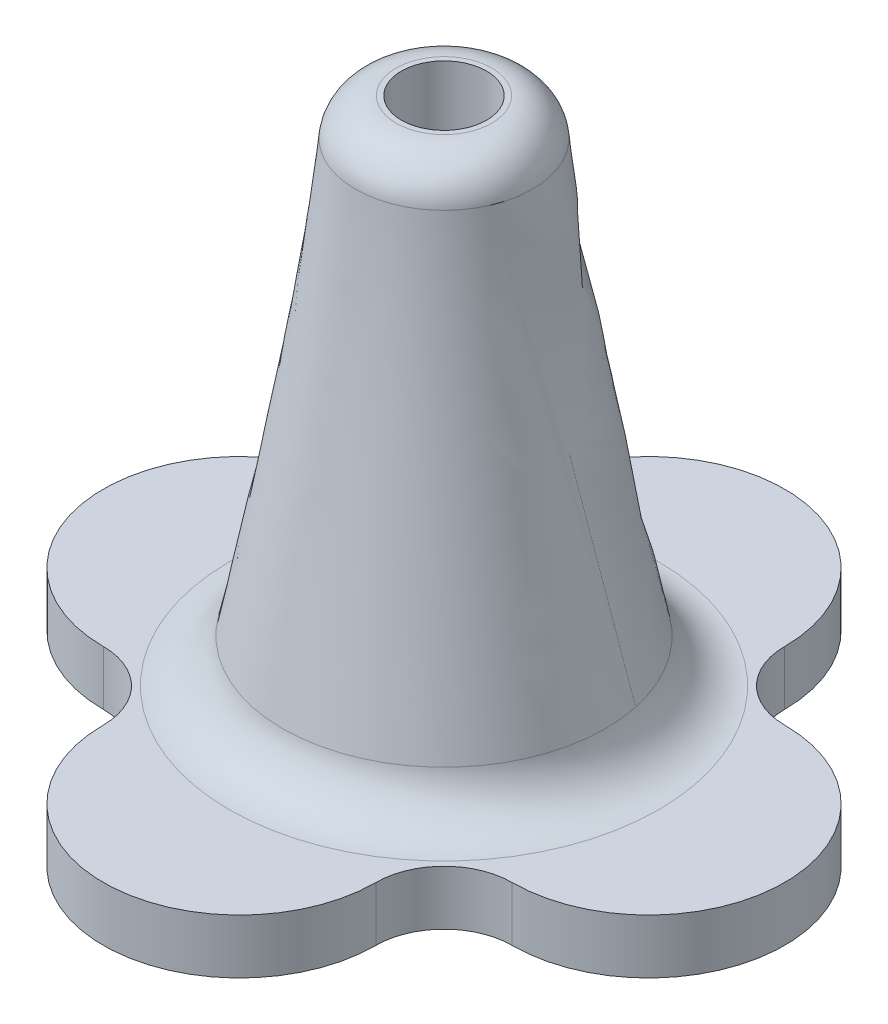
ISO-10303-21;
HEADER;
FILE_DESCRIPTION(('STEP AP214'),'2;1');
FILE_NAME('part.step','',(''),(''),'','','');
FILE_SCHEMA(('AUTOMOTIVE_DESIGN { 1 0 10303 214 1 1 1 1 }'));
ENDSEC;
DATA;
#1=APPLICATION_CONTEXT('core data for automotive mechanical design processes');
#2=APPLICATION_PROTOCOL_DEFINITION('international standard','automotive_design',2000,#1);
#3=PRODUCT_CONTEXT('',#1,'mechanical');
#4=PRODUCT('Part','Part','',(#3));
#5=PRODUCT_RELATED_PRODUCT_CATEGORY('part','',(#4));
#6=PRODUCT_DEFINITION_FORMATION('','',#4);
#7=PRODUCT_DEFINITION_CONTEXT('part definition',#1,'design');
#8=PRODUCT_DEFINITION('design','',#6,#7);
#9=PRODUCT_DEFINITION_SHAPE('','',#8);
#10=(LENGTH_UNIT() NAMED_UNIT(*) SI_UNIT(.MILLI.,.METRE.));
#11=(NAMED_UNIT(*) PLANE_ANGLE_UNIT() SI_UNIT($,.RADIAN.));
#12=(NAMED_UNIT(*) SI_UNIT($,.STERADIAN.) SOLID_ANGLE_UNIT());
#13=UNCERTAINTY_MEASURE_WITH_UNIT(LENGTH_MEASURE(1.E-05),#10,'distance_accuracy_value','');
#14=(GEOMETRIC_REPRESENTATION_CONTEXT(3) GLOBAL_UNCERTAINTY_ASSIGNED_CONTEXT((#13)) GLOBAL_UNIT_ASSIGNED_CONTEXT((#10,
#11,#12)) REPRESENTATION_CONTEXT('',''));
#15=CARTESIAN_POINT('',(0.,0.,0.));
#16=DIRECTION('',(0.,0.,1.));
#17=DIRECTION('',(1.,0.,0.));
#18=AXIS2_PLACEMENT_3D('',#15,#16,#17);
#19=CARTESIAN_POINT('',(0.,2.032,7.61999999999999));
#20=DIRECTION('',(0.,1.,0.));
#21=DIRECTION('',(0.,0.,1.));
#22=AXIS2_PLACEMENT_3D('',#19,#20,#21);
#23=PLANE('',#22);
#24=CARTESIAN_POINT('',(0.,2.032,0.));
#25=DIRECTION('',(0.,1.,0.));
#26=DIRECTION('',(0.,0.,1.));
#27=AXIS2_PLACEMENT_3D('',#24,#25,#26);
#28=CIRCLE('',#27,8.00168832977599);
#29=CARTESIAN_POINT('',(0.,2.032,8.00168832977599));
#30=VERTEX_POINT('',#29);
#31=EDGE_CURVE('E158',#30,#30,#28,.F.);
#32=ORIENTED_EDGE('',*,*,#31,.T.);
#33=EDGE_LOOP('',(#32));
#34=FACE_BOUND('',#33,.T.);
#35=CARTESIAN_POINT('',(0.,2.032,7.61999999999999));
#36=DIRECTION('',(0.,1.,0.));
#37=DIRECTION('',(0.,0.,1.));
#38=AXIS2_PLACEMENT_3D('',#35,#36,#37);
#39=CIRCLE('',#38,5.08);
#40=CARTESIAN_POINT('',(-5.08,2.032,7.61999999999999));
#41=VERTEX_POINT('',#40);
#42=CARTESIAN_POINT('',(5.08,2.032,7.61999999999999));
#43=VERTEX_POINT('',#42);
#44=EDGE_CURVE('E92',#41,#43,#39,.T.);
#45=ORIENTED_EDGE('',*,*,#44,.T.);
#46=CARTESIAN_POINT('',(7.62,2.032,7.62));
#47=DIRECTION('',(0.,1.,0.));
#48=DIRECTION('',(0.,0.,1.));
#49=AXIS2_PLACEMENT_3D('',#46,#47,#48);
#50=CIRCLE('',#49,2.54);
#51=CARTESIAN_POINT('',(7.61999999999999,2.032,5.08));
#52=VERTEX_POINT('',#51);
#53=EDGE_CURVE('E149',#43,#52,#50,.F.);
#54=ORIENTED_EDGE('',*,*,#53,.T.);
#55=CARTESIAN_POINT('',(7.61999999999999,2.032,0.));
#56=DIRECTION('',(0.,1.,0.));
#57=DIRECTION('',(0.,0.,1.));
#58=AXIS2_PLACEMENT_3D('',#55,#56,#57);
#59=CIRCLE('',#58,5.08);
#60=CARTESIAN_POINT('',(7.61999999999999,2.032,-5.08));
#61=VERTEX_POINT('',#60);
#62=EDGE_CURVE('E220',#52,#61,#59,.T.);
#63=ORIENTED_EDGE('',*,*,#62,.T.);
#64=CARTESIAN_POINT('',(7.62,2.032,-7.62));
#65=DIRECTION('',(0.,1.,0.));
#66=DIRECTION('',(0.,0.,1.));
#67=AXIS2_PLACEMENT_3D('',#64,#65,#66);
#68=CIRCLE('',#67,2.54);
#69=CARTESIAN_POINT('',(5.08,2.032,-7.61999999999999));
#70=VERTEX_POINT('',#69);
#71=EDGE_CURVE('E153',#61,#70,#68,.F.);
#72=ORIENTED_EDGE('',*,*,#71,.T.);
#73=CARTESIAN_POINT('',(0.,2.032,-7.61999999999999));
#74=DIRECTION('',(0.,1.,0.));
#75=DIRECTION('',(0.,0.,1.));
#76=AXIS2_PLACEMENT_3D('',#73,#74,#75);
#77=CIRCLE('',#76,5.08);
#78=CARTESIAN_POINT('',(-5.08,2.032,-7.61999999999999));
#79=VERTEX_POINT('',#78);
#80=EDGE_CURVE('E111',#70,#79,#77,.T.);
#81=ORIENTED_EDGE('',*,*,#80,.T.);
#82=CARTESIAN_POINT('',(-7.62,2.032,-7.62));
#83=DIRECTION('',(0.,1.,0.));
#84=DIRECTION('',(0.,0.,1.));
#85=AXIS2_PLACEMENT_3D('',#82,#83,#84);
#86=CIRCLE('',#85,2.54);
#87=CARTESIAN_POINT('',(-7.61999999999999,2.032,-5.08));
#88=VERTEX_POINT('',#87);
#89=EDGE_CURVE('E106',#79,#88,#86,.F.);
#90=ORIENTED_EDGE('',*,*,#89,.T.);
#91=CARTESIAN_POINT('',(-7.61999999999999,2.032,0.));
#92=DIRECTION('',(0.,1.,0.));
#93=DIRECTION('',(0.,0.,1.));
#94=AXIS2_PLACEMENT_3D('',#91,#92,#93);
#95=CIRCLE('',#94,5.08);
#96=CARTESIAN_POINT('',(-7.61999999999999,2.032,5.08));
#97=VERTEX_POINT('',#96);
#98=EDGE_CURVE('E108',#88,#97,#95,.T.);
#99=ORIENTED_EDGE('',*,*,#98,.T.);
#100=CARTESIAN_POINT('',(-7.62,2.032,7.62));
#101=DIRECTION('',(0.,1.,0.));
#102=DIRECTION('',(0.,0.,1.));
#103=AXIS2_PLACEMENT_3D('',#100,#101,#102);
#104=CIRCLE('',#103,2.54);
#105=EDGE_CURVE('E53',#97,#41,#104,.F.);
#106=ORIENTED_EDGE('',*,*,#105,.T.);
#107=EDGE_LOOP('',(#45,#54,#63,#72,#81,#90,#99,#106));
#108=FACE_BOUND('',#107,.T.);
#109=ADVANCED_FACE('F36',(#34,#108),#23,.T.);
#110=CARTESIAN_POINT('',(0.,2.032,7.61999999999999));
#111=DIRECTION('',(0.,-1.,0.));
#112=DIRECTION('',(0.,0.,-1.));
#113=AXIS2_PLACEMENT_3D('',#110,#111,#112);
#114=CYLINDRICAL_SURFACE('',#113,5.08);
#115=CARTESIAN_POINT('',(0.,0.,7.61999999999999));
#116=DIRECTION('',(0.,1.,0.));
#117=DIRECTION('',(0.,0.,1.));
#118=AXIS2_PLACEMENT_3D('',#115,#116,#117);
#119=CIRCLE('',#118,5.08);
#120=CARTESIAN_POINT('',(-5.08,0.,7.61999999999999));
#121=VERTEX_POINT('',#120);
#122=CARTESIAN_POINT('',(5.08,0.,7.61999999999999));
#123=VERTEX_POINT('',#122);
#124=EDGE_CURVE('E227',#121,#123,#119,.T.);
#125=ORIENTED_EDGE('',*,*,#124,.T.);
#126=DIRECTION('',(0.,-1.,0.));
#127=VECTOR('',#126,1.);
#128=CARTESIAN_POINT('',(5.08,2.032,7.61999999999999));
#129=LINE('',#128,#127);
#130=EDGE_CURVE('E141',#43,#123,#129,.T.);
#131=ORIENTED_EDGE('',*,*,#130,.F.);
#132=ORIENTED_EDGE('',*,*,#44,.F.);
#133=DIRECTION('',(0.,-1.,0.));
#134=VECTOR('',#133,1.);
#135=CARTESIAN_POINT('',(-5.08,2.032,7.61999999999999));
#136=LINE('',#135,#134);
#137=EDGE_CURVE('E123',#41,#121,#136,.T.);
#138=ORIENTED_EDGE('',*,*,#137,.T.);
#139=EDGE_LOOP('',(#125,#131,#132,#138));
#140=FACE_BOUND('',#139,.T.);
#141=ADVANCED_FACE('F176',(#140),#114,.T.);
#142=CARTESIAN_POINT('',(7.61999999999999,2.032,0.));
#143=DIRECTION('',(0.,-1.,0.));
#144=DIRECTION('',(0.,0.,-1.));
#145=AXIS2_PLACEMENT_3D('',#142,#143,#144);
#146=CYLINDRICAL_SURFACE('',#145,5.08);
#147=CARTESIAN_POINT('',(7.61999999999999,0.,0.));
#148=DIRECTION('',(0.,1.,0.));
#149=DIRECTION('',(0.,0.,1.));
#150=AXIS2_PLACEMENT_3D('',#147,#148,#149);
#151=CIRCLE('',#150,5.08);
#152=CARTESIAN_POINT('',(7.61999999999999,0.,5.08));
#153=VERTEX_POINT('',#152);
#154=CARTESIAN_POINT('',(7.61999999999999,0.,-5.08));
#155=VERTEX_POINT('',#154);
#156=EDGE_CURVE('E230',#153,#155,#151,.T.);
#157=ORIENTED_EDGE('',*,*,#156,.T.);
#158=DIRECTION('',(0.,-1.,0.));
#159=VECTOR('',#158,1.);
#160=CARTESIAN_POINT('',(7.61999999999999,2.032,-5.08));
#161=LINE('',#160,#159);
#162=EDGE_CURVE('E135',#61,#155,#161,.T.);
#163=ORIENTED_EDGE('',*,*,#162,.F.);
#164=ORIENTED_EDGE('',*,*,#62,.F.);
#165=DIRECTION('',(0.,-1.,0.));
#166=VECTOR('',#165,1.);
#167=CARTESIAN_POINT('',(7.61999999999999,2.032,5.08));
#168=LINE('',#167,#166);
#169=EDGE_CURVE('E138',#52,#153,#168,.T.);
#170=ORIENTED_EDGE('',*,*,#169,.T.);
#171=EDGE_LOOP('',(#157,#163,#164,#170));
#172=FACE_BOUND('',#171,.T.);
#173=ADVANCED_FACE('F182',(#172),#146,.T.);
#174=CARTESIAN_POINT('',(0.,2.032,-7.61999999999999));
#175=DIRECTION('',(0.,-1.,0.));
#176=DIRECTION('',(0.,0.,-1.));
#177=AXIS2_PLACEMENT_3D('',#174,#175,#176);
#178=CYLINDRICAL_SURFACE('',#177,5.08);
#179=CARTESIAN_POINT('',(0.,0.,-7.61999999999999));
#180=DIRECTION('',(0.,1.,0.));
#181=DIRECTION('',(0.,0.,1.));
#182=AXIS2_PLACEMENT_3D('',#179,#180,#181);
#183=CIRCLE('',#182,5.08);
#184=CARTESIAN_POINT('',(5.08,0.,-7.61999999999999));
#185=VERTEX_POINT('',#184);
#186=CARTESIAN_POINT('',(-5.08,0.,-7.61999999999999));
#187=VERTEX_POINT('',#186);
#188=EDGE_CURVE('E234',#185,#187,#183,.T.);
#189=ORIENTED_EDGE('',*,*,#188,.T.);
#190=DIRECTION('',(0.,-1.,0.));
#191=VECTOR('',#190,1.);
#192=CARTESIAN_POINT('',(-5.08,2.032,-7.61999999999999));
#193=LINE('',#192,#191);
#194=EDGE_CURVE('E126',#79,#187,#193,.T.);
#195=ORIENTED_EDGE('',*,*,#194,.F.);
#196=ORIENTED_EDGE('',*,*,#80,.F.);
#197=DIRECTION('',(0.,-1.,0.));
#198=VECTOR('',#197,1.);
#199=CARTESIAN_POINT('',(5.08,2.032,-7.61999999999999));
#200=LINE('',#199,#198);
#201=EDGE_CURVE('E128',#70,#185,#200,.T.);
#202=ORIENTED_EDGE('',*,*,#201,.T.);
#203=EDGE_LOOP('',(#189,#195,#196,#202));
#204=FACE_BOUND('',#203,.T.);
#205=ADVANCED_FACE('F193',(#204),#178,.T.);
#206=CARTESIAN_POINT('',(-7.61999999999999,2.032,0.));
#207=DIRECTION('',(0.,-1.,0.));
#208=DIRECTION('',(0.,0.,-1.));
#209=AXIS2_PLACEMENT_3D('',#206,#207,#208);
#210=CYLINDRICAL_SURFACE('',#209,5.08);
#211=CARTESIAN_POINT('',(-7.61999999999999,0.,0.));
#212=DIRECTION('',(0.,1.,0.));
#213=DIRECTION('',(0.,0.,1.));
#214=AXIS2_PLACEMENT_3D('',#211,#212,#213);
#215=CIRCLE('',#214,5.08);
#216=CARTESIAN_POINT('',(-7.61999999999999,0.,-5.08));
#217=VERTEX_POINT('',#216);
#218=CARTESIAN_POINT('',(-7.61999999999999,0.,5.08));
#219=VERTEX_POINT('',#218);
#220=EDGE_CURVE('E236',#217,#219,#215,.T.);
#221=ORIENTED_EDGE('',*,*,#220,.T.);
#222=DIRECTION('',(0.,-1.,0.));
#223=VECTOR('',#222,1.);
#224=CARTESIAN_POINT('',(-7.61999999999999,2.032,5.08));
#225=LINE('',#224,#223);
#226=EDGE_CURVE('E122',#97,#219,#225,.T.);
#227=ORIENTED_EDGE('',*,*,#226,.F.);
#228=ORIENTED_EDGE('',*,*,#98,.F.);
#229=DIRECTION('',(0.,-1.,0.));
#230=VECTOR('',#229,1.);
#231=CARTESIAN_POINT('',(-7.61999999999999,2.032,-5.08));
#232=LINE('',#231,#230);
#233=EDGE_CURVE('E121',#88,#217,#232,.T.);
#234=ORIENTED_EDGE('',*,*,#233,.T.);
#235=EDGE_LOOP('',(#221,#227,#228,#234));
#236=FACE_BOUND('',#235,.T.);
#237=ADVANCED_FACE('F120',(#236),#210,.T.);
#238=CARTESIAN_POINT('',(0.,0.,7.61999999999999));
#239=DIRECTION('',(0.,1.,0.));
#240=DIRECTION('',(0.,0.,1.));
#241=AXIS2_PLACEMENT_3D('',#238,#239,#240);
#242=PLANE('',#241);
#243=ORIENTED_EDGE('',*,*,#124,.F.);
#244=CARTESIAN_POINT('',(-7.62,0.,7.62));
#245=DIRECTION('',(0.,1.,0.));
#246=DIRECTION('',(0.,0.,1.));
#247=AXIS2_PLACEMENT_3D('',#244,#245,#246);
#248=CIRCLE('',#247,2.54);
#249=EDGE_CURVE('E82',#121,#219,#248,.T.);
#250=ORIENTED_EDGE('',*,*,#249,.T.);
#251=ORIENTED_EDGE('',*,*,#220,.F.);
#252=CARTESIAN_POINT('',(-7.62,0.,-7.62));
#253=DIRECTION('',(0.,1.,0.));
#254=DIRECTION('',(0.,0.,1.));
#255=AXIS2_PLACEMENT_3D('',#252,#253,#254);
#256=CIRCLE('',#255,2.54);
#257=EDGE_CURVE('E116',#217,#187,#256,.T.);
#258=ORIENTED_EDGE('',*,*,#257,.T.);
#259=ORIENTED_EDGE('',*,*,#188,.F.);
#260=CARTESIAN_POINT('',(7.62,0.,-7.62));
#261=DIRECTION('',(0.,1.,0.));
#262=DIRECTION('',(0.,0.,1.));
#263=AXIS2_PLACEMENT_3D('',#260,#261,#262);
#264=CIRCLE('',#263,2.54);
#265=EDGE_CURVE('E151',#185,#155,#264,.T.);
#266=ORIENTED_EDGE('',*,*,#265,.T.);
#267=ORIENTED_EDGE('',*,*,#156,.F.);
#268=CARTESIAN_POINT('',(7.62,0.,7.62));
#269=DIRECTION('',(0.,1.,0.));
#270=DIRECTION('',(0.,0.,1.));
#271=AXIS2_PLACEMENT_3D('',#268,#269,#270);
#272=CIRCLE('',#271,2.54);
#273=EDGE_CURVE('E147',#153,#123,#272,.T.);
#274=ORIENTED_EDGE('',*,*,#273,.T.);
#275=EDGE_LOOP('',(#243,#250,#251,#258,#259,#266,#267,#274));
#276=FACE_BOUND('',#275,.T.);
#277=ADVANCED_FACE('F188',(#276),#242,.F.);
#278=CARTESIAN_POINT('',(-7.62,2.032,-7.62));
#279=DIRECTION('',(0.,1.,0.));
#280=DIRECTION('',(0.,0.,1.));
#281=AXIS2_PLACEMENT_3D('',#278,#279,#280);
#282=CYLINDRICAL_SURFACE('',#281,2.54);
#283=ORIENTED_EDGE('',*,*,#89,.F.);
#284=ORIENTED_EDGE('',*,*,#194,.T.);
#285=ORIENTED_EDGE('',*,*,#257,.F.);
#286=ORIENTED_EDGE('',*,*,#233,.F.);
#287=EDGE_LOOP('',(#283,#284,#285,#286));
#288=FACE_BOUND('',#287,.T.);
#289=ADVANCED_FACE('F125',(#288),#282,.F.);
#290=CARTESIAN_POINT('',(-7.62,2.032,7.62));
#291=DIRECTION('',(0.,1.,0.));
#292=DIRECTION('',(0.,0.,1.));
#293=AXIS2_PLACEMENT_3D('',#290,#291,#292);
#294=CYLINDRICAL_SURFACE('',#293,2.54);
#295=ORIENTED_EDGE('',*,*,#105,.F.);
#296=ORIENTED_EDGE('',*,*,#226,.T.);
#297=ORIENTED_EDGE('',*,*,#249,.F.);
#298=ORIENTED_EDGE('',*,*,#137,.F.);
#299=EDGE_LOOP('',(#295,#296,#297,#298));
#300=FACE_BOUND('',#299,.T.);
#301=ADVANCED_FACE('F202',(#300),#294,.F.);
#302=CARTESIAN_POINT('',(7.62,2.032,7.62));
#303=DIRECTION('',(0.,1.,0.));
#304=DIRECTION('',(0.,0.,1.));
#305=AXIS2_PLACEMENT_3D('',#302,#303,#304);
#306=CYLINDRICAL_SURFACE('',#305,2.54);
#307=ORIENTED_EDGE('',*,*,#53,.F.);
#308=ORIENTED_EDGE('',*,*,#130,.T.);
#309=ORIENTED_EDGE('',*,*,#273,.F.);
#310=ORIENTED_EDGE('',*,*,#169,.F.);
#311=EDGE_LOOP('',(#307,#308,#309,#310));
#312=FACE_BOUND('',#311,.T.);
#313=ADVANCED_FACE('F205',(#312),#306,.F.);
#314=CARTESIAN_POINT('',(7.62,2.032,-7.62));
#315=DIRECTION('',(0.,1.,0.));
#316=DIRECTION('',(0.,0.,1.));
#317=AXIS2_PLACEMENT_3D('',#314,#315,#316);
#318=CYLINDRICAL_SURFACE('',#317,2.54);
#319=ORIENTED_EDGE('',*,*,#71,.F.);
#320=ORIENTED_EDGE('',*,*,#162,.T.);
#321=ORIENTED_EDGE('',*,*,#265,.F.);
#322=ORIENTED_EDGE('',*,*,#201,.F.);
#323=EDGE_LOOP('',(#319,#320,#321,#322));
#324=FACE_BOUND('',#323,.T.);
#325=ADVANCED_FACE('F208',(#324),#318,.F.);
#326=CARTESIAN_POINT('',(0.,21.082,0.));
#327=DIRECTION('',(0.,1.,0.));
#328=DIRECTION('',(0.,0.,1.));
#329=AXIS2_PLACEMENT_3D('',#326,#327,#328);
#330=PLANE('',#329);
#331=CARTESIAN_POINT('',(0.,21.082,0.));
#332=DIRECTION('',(0.,1.,0.));
#333=DIRECTION('',(0.,0.,1.));
#334=AXIS2_PLACEMENT_3D('',#331,#332,#333);
#335=CIRCLE('',#334,1.78171466491109);
#336=CARTESIAN_POINT('',(0.,21.082,1.7817146649111));
#337=VERTEX_POINT('',#336);
#338=EDGE_CURVE('E45',#337,#337,#335,.T.);
#339=ORIENTED_EDGE('',*,*,#338,.T.);
#340=EDGE_LOOP('',(#339));
#341=FACE_BOUND('',#340,.T.);
#342=CARTESIAN_POINT('',(0.,21.082,0.));
#343=DIRECTION('',(0.,1.,0.));
#344=DIRECTION('',(0.,0.,1.));
#345=AXIS2_PLACEMENT_3D('',#342,#343,#344);
#346=CIRCLE('',#345,1.5875);
#347=CARTESIAN_POINT('',(0.,21.082,1.5875));
#348=VERTEX_POINT('',#347);
#349=EDGE_CURVE('E243',#348,#348,#346,.T.);
#350=ORIENTED_EDGE('',*,*,#349,.F.);
#351=EDGE_LOOP('',(#350));
#352=FACE_BOUND('',#351,.T.);
#353=ADVANCED_FACE('F163',(#341,#352),#330,.T.);
#354=CARTESIAN_POINT('',(6.16511311944894,2.032,-1.5211443798662));
#355=CARTESIAN_POINT('',(2.78706525060156,21.082,1.52081961089712));
#356=CARTESIAN_POINT('',(3.12282435971653,2.032,-13.8513706187641));
#357=CARTESIAN_POINT('',(5.82870447239579,21.082,-4.05331089030601));
#358=CARTESIAN_POINT('',(-9.20740187918135,2.032,-10.8090818590317));
#359=CARTESIAN_POINT('',(0.254573971192672,21.082,-7.09495011210024));
#360=CARTESIAN_POINT('',(-6.16511311944894,2.032,1.52114437986621));
#361=CARTESIAN_POINT('',(-2.78706525060156,21.082,-1.52081961089712));
#362=CARTESIAN_POINT('',(-3.12282435971652,2.032,13.8513706187641));
#363=CARTESIAN_POINT('',(-5.82870447239579,21.082,4.053310890306));
#364=CARTESIAN_POINT('',(9.20740187918135,2.032,10.8090818590317));
#365=CARTESIAN_POINT('',(-0.254573971192671,21.082,7.09495011210024));
#366=CARTESIAN_POINT('',(6.16511311944894,2.032,-1.5211443798662));
#367=CARTESIAN_POINT('',(2.78706525060156,21.082,1.52081961089712));
#368=(BOUNDED_SURFACE() B_SPLINE_SURFACE(3,1,((#354,#355),(#356,#357),(#358,#359),(#360,#361),
(#362,#363),(#364,#365),(#366,#367)),.UNSPECIFIED.,.T.,.F.,.F.) B_SPLINE_SURFACE_WITH_KNOTS((4,
3,4),(2,2),(0.,0.5,1.),(0.,1.),
.UNSPECIFIED.) GEOMETRIC_REPRESENTATION_ITEM() RATIONAL_B_SPLINE_SURFACE(((1.,1.),
(0.333333333333333,0.333333333333333),(0.333333333333333,0.333333333333333),(1.,1.),
(0.333333333333333,0.333333333333333),(0.333333333333333,0.333333333333333),(1.,1.))) REPRESENTATION_ITEM('') SURFACE());
#369=CARTESIAN_POINT('',(0.,19.7095095018148,0.));
#370=DIRECTION('',(0.,1.,0.));
#371=DIRECTION('',(0.,0.,1.));
#372=AXIS2_PLACEMENT_3D('',#369,#370,#371);
#373=CIRCLE('',#372,3.29816475339401);
#374=CARTESIAN_POINT('',(3.03044260505867,19.7095095018148,1.30165600600765));
#375=VERTEX_POINT('',#374);
#376=EDGE_CURVE('E12',#375,#375,#373,.F.);
#377=CARTESIAN_POINT('',(0.,3.65229272788117,0.));
#378=DIRECTION('',(0.,1.,0.));
#379=DIRECTION('',(0.,0.,1.));
#380=AXIS2_PLACEMENT_3D('',#377,#378,#379);
#381=CIRCLE('',#380,6.01183378180408);
#382=CARTESIAN_POINT('',(5.87779414851309,3.65229272788117,-1.26241093457958));
#383=VERTEX_POINT('',#382);
#384=EDGE_CURVE('E155',#383,#383,#381,.T.);
#385=CARTESIAN_POINT('',(3.03044260505867,19.7095095018148,1.30165600600765));
#386=CARTESIAN_POINT('',(3.06010251696965,19.5422468270863,1.27494697537654));
#387=CARTESIAN_POINT('',(3.08976242888063,19.3749841523578,1.24823794474542));
#388=CARTESIAN_POINT('',(3.1490822527026,19.0404588029009,1.19481988348319));
#389=CARTESIAN_POINT('',(3.17874216461358,18.8731961281724,1.16811085285207));
#390=CARTESIAN_POINT('',(3.23806198843555,18.5386707787155,1.11469279158984));
#391=CARTESIAN_POINT('',(3.26772190034653,18.371408103987,1.08798376095872));
#392=CARTESIAN_POINT('',(3.3270417241685,18.03688275453,1.03456569969648));
#393=CARTESIAN_POINT('',(3.35670163607949,17.8696200798016,1.00785666906537));
#394=CARTESIAN_POINT('',(3.41602145990145,17.5350947303446,0.954438607803133));
#395=CARTESIAN_POINT('',(3.44568137181244,17.3678320556161,0.927729577172016));
#396=CARTESIAN_POINT('',(3.5050011956344,17.0333067061592,0.874311515909782));
#397=CARTESIAN_POINT('',(3.53466110754539,16.8660440314307,0.847602485278665));
#398=CARTESIAN_POINT('',(3.59398093136735,16.5315186819738,0.794184424016431));
#399=CARTESIAN_POINT('',(3.62364084327834,16.3642560072453,0.767475393385314));
#400=CARTESIAN_POINT('',(3.68296066710031,16.0297306577883,0.71405733212308));
#401=CARTESIAN_POINT('',(3.71262057901129,15.8624679830599,0.687348301491963));
#402=CARTESIAN_POINT('',(3.77194040283326,15.5279426336029,0.633930240229729));
#403=CARTESIAN_POINT('',(3.80160031474424,15.3606799588744,0.607221209598612));
#404=CARTESIAN_POINT('',(3.86092013856621,15.0261546094175,0.553803148336378));
#405=CARTESIAN_POINT('',(3.89058005047719,14.858891934689,0.527094117705261));
#406=CARTESIAN_POINT('',(3.94989987429916,14.5243665852321,0.473676056443027));
#407=CARTESIAN_POINT('',(3.97955978621014,14.3571039105036,0.44696702581191));
#408=CARTESIAN_POINT('',(4.03887961003211,14.0225785610466,0.393548964549676));
#409=CARTESIAN_POINT('',(4.06853952194309,13.8553158863182,0.366839933918559));
#410=CARTESIAN_POINT('',(4.12785934576506,13.5207905368612,0.313421872656325));
#411=CARTESIAN_POINT('',(4.15751925767604,13.3535278621327,0.286712842025208));
#412=CARTESIAN_POINT('',(4.21683908149801,13.0190025126758,0.233294780762974));
#413=CARTESIAN_POINT('',(4.24649899340899,12.8517398379473,0.206585750131857));
#414=CARTESIAN_POINT('',(4.30581881723096,12.5172144884903,0.153167688869622));
#415=CARTESIAN_POINT('',(4.33547872914194,12.3499518137619,0.126458658238505));
#416=CARTESIAN_POINT('',(4.39479855296391,12.0154264643049,0.0730405969762713));
#417=CARTESIAN_POINT('',(4.42445846487489,11.8481637895764,0.0463315663451544));
#418=CARTESIAN_POINT('',(4.48377828869686,11.5136384401195,-0.00708649491707953));
#419=CARTESIAN_POINT('',(4.51343820060784,11.346375765391,-0.0337955255481966));
#420=CARTESIAN_POINT('',(4.57275802442981,11.0118504159341,-0.0872135868104306));
#421=CARTESIAN_POINT('',(4.6024179363408,10.8445877412056,-0.113922617441548));
#422=CARTESIAN_POINT('',(4.66173776016276,10.5100623917486,-0.167340678703782));
#423=CARTESIAN_POINT('',(4.69139767207375,10.3427997170202,-0.194049709334899));
#424=CARTESIAN_POINT('',(4.75071749589571,10.0082743675632,-0.247467770597133));
#425=CARTESIAN_POINT('',(4.7803774078067,9.84101169283475,-0.27417680122825));
#426=CARTESIAN_POINT('',(4.83969723162866,9.5064863433778,-0.327594862490484));
#427=CARTESIAN_POINT('',(4.86935714353965,9.33922366864932,-0.354303893121601));
#428=CARTESIAN_POINT('',(4.92867696736162,9.00469831919237,-0.407721954383835));
#429=CARTESIAN_POINT('',(4.9583368792726,8.8374356444639,-0.434430985014952));
#430=CARTESIAN_POINT('',(5.01765670309457,8.50291029500695,-0.487849046277186));
#431=CARTESIAN_POINT('',(5.04731661500555,8.33564762027847,-0.514558076908303));
#432=CARTESIAN_POINT('',(5.10663643882752,8.00112227082152,-0.567976138170537));
#433=CARTESIAN_POINT('',(5.1362963507385,7.83385959609305,-0.594685168801654));
#434=CARTESIAN_POINT('',(5.19561617456047,7.4993342466361,-0.648103230063888));
#435=CARTESIAN_POINT('',(5.22527608647145,7.33207157190762,-0.674812260695005));
#436=CARTESIAN_POINT('',(5.28459591029342,6.99754622245067,-0.728230321957239));
#437=CARTESIAN_POINT('',(5.3142558222044,6.8302835477222,-0.754939352588356));
#438=CARTESIAN_POINT('',(5.37357564602637,6.49575819826525,-0.80835741385059));
#439=CARTESIAN_POINT('',(5.40323555793735,6.32849552353677,-0.835066444481707));
#440=CARTESIAN_POINT('',(5.46255538175932,5.99397017407982,-0.888484505743941));
#441=CARTESIAN_POINT('',(5.4922152936703,5.82670749935134,-0.915193536375059));
#442=CARTESIAN_POINT('',(5.55153511749227,5.49218214989439,-0.968611597637293));
#443=CARTESIAN_POINT('',(5.58119502940325,5.32491947516592,-0.995320628268409));
#444=CARTESIAN_POINT('',(5.64051485322522,4.99039412570897,-1.04873868953064));
#445=CARTESIAN_POINT('',(5.6701747651362,4.82313145098049,-1.07544772016176));
#446=CARTESIAN_POINT('',(5.72949458895817,4.48860610152354,-1.12886578142399));
#447=CARTESIAN_POINT('',(5.75915450086915,4.32134342679507,-1.15557481205511));
#448=CARTESIAN_POINT('',(5.81847432469112,3.98681807733812,-1.20899287331735));
#449=CARTESIAN_POINT('',(5.84813423660211,3.81955540260964,-1.23570190394846));
#450=CARTESIAN_POINT('',(5.87779414851309,3.65229272788117,-1.26241093457958));
#451=B_SPLINE_CURVE_WITH_KNOTS('',3,(#385,#386,#387,#388,#389,#390,#391,#392,#393,#394,#395,
#396,#397,#398,#399,#400,#401,#402,#403,#404,#405,#406,#407,#408,#409,#410,#411,#412,#413,#414,
#415,#416,#417,#418,#419,#420,#421,#422,#423,#424,#425,#426,#427,#428,#429,#430,#431,#432,#433,
#434,#435,#436,#437,#438,#439,#440,#441,#442,#443,#444,#445,#446,#447,#448,#449,#450),
.UNSPECIFIED.,.F.,.F.,(4,2,2,2,2,2,2,2,2,2,2,2,2,2,2,2,2,2,2,2,2,2,2,2,2,2,2,2,2,2,2,2,4),(0.,
0.515876889812194,1.03175377962439,1.54763066943659,2.06350755924878,2.57938444906098,
3.09526133887318,3.61113822868537,4.12701511849757,4.64289200830976,5.15876889812196,
5.67464578793416,6.19052267774635,6.70639956755855,7.22227645737074,7.73815334718294,
8.25403023699513,8.76990712680733,9.28578401661952,9.80166090643172,10.3175377962439,
10.8334146860561,11.3492915758683,11.8651684656805,12.3810453554927,12.8969222453049,
13.4127991351171,13.9286760249293,14.4445529147415,14.9604298045537,15.4763066943659,
15.9921835841781,16.5080604739903),.UNSPECIFIED.);
#452=EDGE_CURVE('BSEAM215',#375,#383,#451,.T.);
#453=ORIENTED_EDGE('',*,*,#376,.T.);
#454=ORIENTED_EDGE('',*,*,#384,.T.);
#455=ORIENTED_EDGE('',*,*,#452,.T.);
#456=ORIENTED_EDGE('',*,*,#452,.F.);
#457=EDGE_LOOP('',(#453,#455,#454,#456));
#458=FACE_BOUND('',#457,.T.);
#459=ADVANCED_FACE('F215',(#458),#368,.T.);
#460=CARTESIAN_POINT('',(0.,-2.45812806053458,0.));
#461=DIRECTION('',(0.,1.,0.));
#462=DIRECTION('',(0.,0.,1.));
#463=AXIS2_PLACEMENT_3D('',#460,#461,#462);
#464=CYLINDRICAL_SURFACE('',#463,1.5875);
#465=CARTESIAN_POINT('',(0.,2.032,0.));
#466=DIRECTION('',(0.,1.,0.));
#467=DIRECTION('',(0.,0.,1.));
#468=AXIS2_PLACEMENT_3D('',#465,#466,#467);
#469=CIRCLE('',#468,1.5875);
#470=CARTESIAN_POINT('',(0.,2.032,1.5875));
#471=VERTEX_POINT('',#470);
#472=EDGE_CURVE('E231',#471,#471,#469,.F.);
#473=ORIENTED_EDGE('',*,*,#472,.T.);
#474=EDGE_LOOP('',(#473));
#475=FACE_BOUND('',#474,.T.);
#476=ORIENTED_EDGE('',*,*,#349,.T.);
#477=EDGE_LOOP('',(#476));
#478=FACE_BOUND('',#477,.T.);
#479=ADVANCED_FACE('F247',(#475,#478),#464,.F.);
#480=CARTESIAN_POINT('',(0.,2.032,7.61999999999999));
#481=DIRECTION('',(0.,1.,0.));
#482=DIRECTION('',(0.,0.,1.));
#483=AXIS2_PLACEMENT_3D('',#480,#481,#482);
#484=PLANE('',#483);
#485=ORIENTED_EDGE('',*,*,#472,.F.);
#486=EDGE_LOOP('',(#485));
#487=FACE_BOUND('',#486,.T.);
#488=ADVANCED_FACE('F172',(#487),#484,.T.);
#489=CARTESIAN_POINT('',(0.,4.064,0.));
#490=DIRECTION('',(0.,1.,0.));
#491=DIRECTION('',(0.,0.,1.));
#492=AXIS2_PLACEMENT_3D('',#489,#490,#491);
#493=TOROIDAL_SURFACE('',#492,8.00168832977599,2.032);
#494=ORIENTED_EDGE('',*,*,#31,.F.);
#495=EDGE_LOOP('',(#494));
#496=FACE_BOUND('',#495,.T.);
#497=ORIENTED_EDGE('',*,*,#384,.F.);
#498=EDGE_LOOP('',(#497));
#499=FACE_BOUND('',#498,.T.);
#500=ADVANCED_FACE('F167',(#496,#499),#493,.F.);
#501=CARTESIAN_POINT('',(0.,19.558,0.));
#502=DIRECTION('',(0.,1.,0.));
#503=DIRECTION('',(0.,0.,1.));
#504=AXIS2_PLACEMENT_3D('',#501,#502,#503);
#505=TOROIDAL_SURFACE('',#504,1.78171466491109,1.524);
#506=ORIENTED_EDGE('',*,*,#376,.F.);
#507=EDGE_LOOP('',(#506));
#508=FACE_BOUND('',#507,.T.);
#509=ORIENTED_EDGE('',*,*,#338,.F.);
#510=EDGE_LOOP('',(#509));
#511=FACE_BOUND('',#510,.T.);
#512=ADVANCED_FACE('F38',(#508,#511),#505,.T.);
#513=CLOSED_SHELL('',(#109,#141,#173,#205,#237,#277,#289,#301,#313,#325,#353,#459,#479,#488,
#500,#512));
#514=MANIFOLD_SOLID_BREP('B2',#513);
#515=ADVANCED_BREP_SHAPE_REPRESENTATION('',(#18,#514),#14);
#516=SHAPE_DEFINITION_REPRESENTATION(#9,#515);
ENDSEC;
END-ISO-10303-21;
